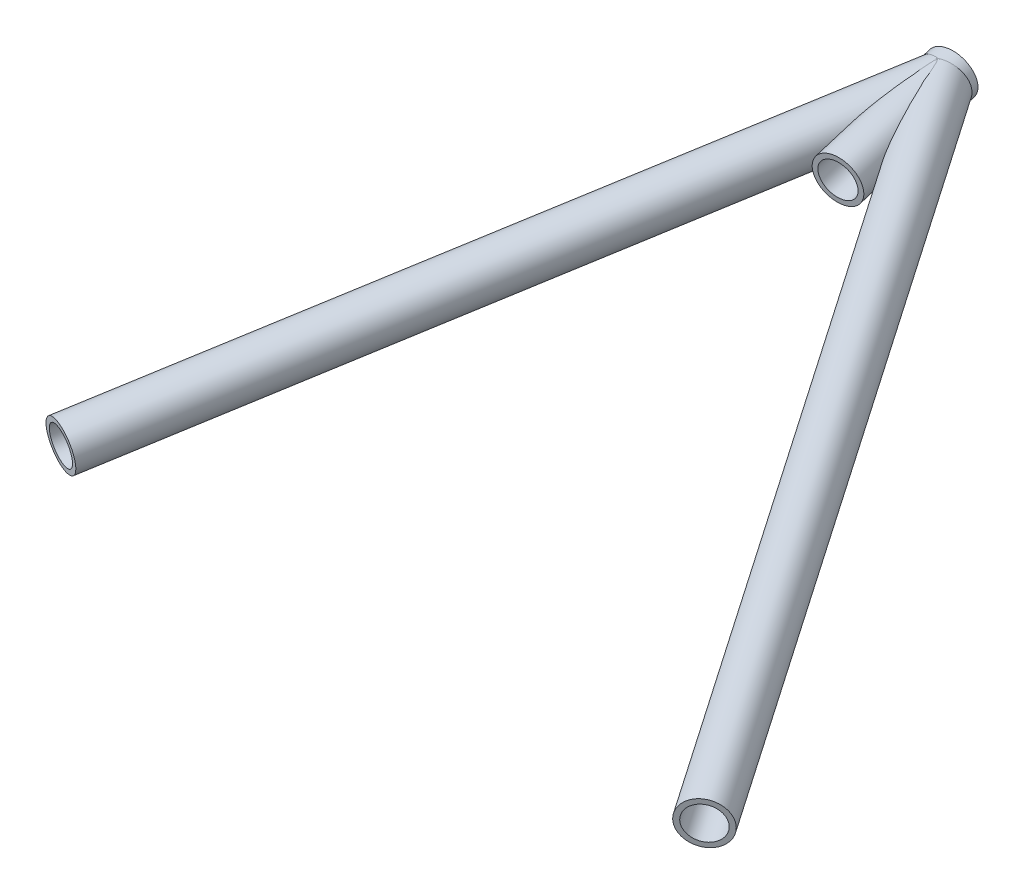
ISO-10303-21;
HEADER;
FILE_DESCRIPTION(('STEP AP214'),'2;1');
FILE_NAME('part.step','',(''),(''),'','','');
FILE_SCHEMA(('AUTOMOTIVE_DESIGN { 1 0 10303 214 1 1 1 1 }'));
ENDSEC;
DATA;
#1=APPLICATION_CONTEXT('core data for automotive mechanical design processes');
#2=APPLICATION_PROTOCOL_DEFINITION('international standard','automotive_design',2000,#1);
#3=PRODUCT_CONTEXT('',#1,'mechanical');
#4=PRODUCT('Part','Part','',(#3));
#5=PRODUCT_RELATED_PRODUCT_CATEGORY('part','',(#4));
#6=PRODUCT_DEFINITION_FORMATION('','',#4);
#7=PRODUCT_DEFINITION_CONTEXT('part definition',#1,'design');
#8=PRODUCT_DEFINITION('design','',#6,#7);
#9=PRODUCT_DEFINITION_SHAPE('','',#8);
#10=(LENGTH_UNIT() NAMED_UNIT(*) SI_UNIT(.MILLI.,.METRE.));
#11=(NAMED_UNIT(*) PLANE_ANGLE_UNIT() SI_UNIT($,.RADIAN.));
#12=(NAMED_UNIT(*) SI_UNIT($,.STERADIAN.) SOLID_ANGLE_UNIT());
#13=UNCERTAINTY_MEASURE_WITH_UNIT(LENGTH_MEASURE(1.E-05),#10,'distance_accuracy_value','');
#14=(GEOMETRIC_REPRESENTATION_CONTEXT(3) GLOBAL_UNCERTAINTY_ASSIGNED_CONTEXT((#13)) GLOBAL_UNIT_ASSIGNED_CONTEXT((#10,
#11,#12)) REPRESENTATION_CONTEXT('',''));
#15=CARTESIAN_POINT('',(0.,0.,0.));
#16=DIRECTION('',(0.,0.,1.));
#17=DIRECTION('',(1.,0.,0.));
#18=AXIS2_PLACEMENT_3D('',#15,#16,#17);
#19=CARTESIAN_POINT('',(4.04397858951078,301.981612494775,-650.872201759845));
#20=DIRECTION('',(0.537160814672258,-0.118768279923982,0.835076256915819));
#21=DIRECTION('',(0.841029061630512,0.,-0.540989942136544));
#22=AXIS2_PLACEMENT_3D('',#19,#20,#21);
#23=CYLINDRICAL_SURFACE('',#22,7.41679999999999);
#24=CARTESIAN_POINT('',(181.199371486471,262.811887676953,-375.464431215176));
#25=DIRECTION('',(-0.537160814672258,0.118768279923982,-0.835076256915819));
#26=DIRECTION('',(-0.841029061630512,0.,0.540989942136544));
#27=AXIS2_PLACEMENT_3D('',#24,#25,#26);
#28=CIRCLE('',#27,7.41679999999999);
#29=CARTESIAN_POINT('',(174.96162714217,262.811887676953,-371.452017012338));
#30=VERTEX_POINT('',#29);
#31=EDGE_CURVE('E109',#30,#30,#28,.T.);
#32=ORIENTED_EDGE('',*,*,#31,.F.);
#33=EDGE_LOOP('',(#32));
#34=FACE_BOUND('',#33,.T.);
#35=CARTESIAN_POINT('',(13.8206980198047,301.199131769866,-649.382885405639));
#36=CARTESIAN_POINT('',(13.8107554513525,301.004834071272,-649.398341630116));
#37=CARTESIAN_POINT('',(13.7955562754114,300.81031650493,-649.407729645231));
#38=CARTESIAN_POINT('',(13.7549430406658,300.42207729142,-649.414063919288));
#39=CARTESIAN_POINT('',(13.7295253039259,300.228355956228,-649.411005694874));
#40=CARTESIAN_POINT('',(13.668941958217,299.842741117412,-649.392047785591));
#41=CARTESIAN_POINT('',(13.6337601344558,299.650851208262,-649.376126655073));
#42=CARTESIAN_POINT('',(13.5544167889339,299.270537861153,-649.330981707171));
#43=CARTESIAN_POINT('',(13.5102560930672,299.082114106107,-649.301759112976));
#44=CARTESIAN_POINT('',(13.4138733302478,298.709728999547,-649.229479511083));
#45=CARTESIAN_POINT('',(13.3616395128709,298.525774612171,-649.18640223751));
#46=CARTESIAN_POINT('',(13.2504182639717,298.163900555168,-649.085932035394));
#47=CARTESIAN_POINT('',(13.1914306445094,297.985981053655,-649.028538708421));
#48=CARTESIAN_POINT('',(13.0683029136179,297.637614486215,-648.899045587752));
#49=CARTESIAN_POINT('',(13.0041674368784,297.467160907693,-648.826958934604));
#50=CARTESIAN_POINT('',(12.8725227679249,297.134801922059,-648.667725156594));
#51=CARTESIAN_POINT('',(12.8050137756413,296.97289600954,-648.580578923483));
#52=CARTESIAN_POINT('',(12.6712778858714,296.664743370898,-648.394730859944));
#53=CARTESIAN_POINT('',(12.6050995287082,296.518135582986,-648.296592926979));
#54=CARTESIAN_POINT('',(12.4735188770187,296.234788709822,-648.086519826771));
#55=CARTESIAN_POINT('',(12.4081165453744,296.09804915096,-647.974585322371));
#56=CARTESIAN_POINT('',(12.2801144376949,295.835180292405,-647.737583976231));
#57=CARTESIAN_POINT('',(12.2175132854605,295.709045755163,-647.612523686415));
#58=CARTESIAN_POINT('',(12.0969252721962,295.467697872211,-647.350245684631));
#59=CARTESIAN_POINT('',(12.0389382973799,295.352484257176,-647.213028272638));
#60=CARTESIAN_POINT('',(11.9324335470402,295.139664175803,-646.936470775977));
#61=CARTESIAN_POINT('',(11.8835549379273,295.041413898014,-646.797762846696));
#62=CARTESIAN_POINT('',(11.7921268498346,294.854321863066,-646.512189866713));
#63=CARTESIAN_POINT('',(11.749577031769,294.765479601915,-646.365325253612));
#64=CARTESIAN_POINT('',(11.6713411448821,294.596699505589,-646.064830133391));
#65=CARTESIAN_POINT('',(11.6356551461025,294.516761761284,-645.911199557248));
#66=CARTESIAN_POINT('',(11.5713225100739,294.365118415464,-645.598512850049));
#67=CARTESIAN_POINT('',(11.542676759512,294.293413851486,-645.439456038454));
#68=CARTESIAN_POINT('',(11.4745160510541,294.10931638736,-645.002956586368));
#69=CARTESIAN_POINT('',(11.4416681524004,294.004065976785,-644.721438375182));
#70=CARTESIAN_POINT('',(11.3945133199791,293.811412551757,-644.150839365053));
#71=CARTESIAN_POINT('',(11.3802205709604,293.724023234418,-643.861752952508));
#72=CARTESIAN_POINT('',(11.3676547219348,293.563276507303,-643.278011118803));
#73=CARTESIAN_POINT('',(11.3694552757307,293.489985182082,-642.98333625847));
#74=CARTESIAN_POINT('',(11.3823925957435,293.3888363993,-642.539762543802));
#75=CARTESIAN_POINT('',(11.3884098657996,293.356587970583,-642.391661137573));
#76=CARTESIAN_POINT('',(11.4035636408006,293.294724262012,-642.095064628122));
#77=CARTESIAN_POINT('',(11.4127001587891,293.265108993171,-641.946569523257));
#78=CARTESIAN_POINT('',(11.4403698044794,293.190601887475,-641.557073858043));
#79=CARTESIAN_POINT('',(11.4612153441587,293.147638280028,-641.315868062194));
#80=CARTESIAN_POINT('',(11.5093306970782,293.067025227133,-640.833194783426));
#81=CARTESIAN_POINT('',(11.5366014187548,293.029376534349,-640.591727268312));
#82=CARTESIAN_POINT('',(11.5966888754498,292.958666974247,-640.108693173126));
#83=CARTESIAN_POINT('',(11.6295083776565,292.925608411092,-639.867126603915));
#84=CARTESIAN_POINT('',(11.6999325025681,292.863542897817,-639.384164978302));
#85=CARTESIAN_POINT('',(11.7375374294296,292.834536205476,-639.142769933785));
#86=CARTESIAN_POINT('',(11.8567176155296,292.752789672647,-638.417935731447));
#87=CARTESIAN_POINT('',(11.9445212330136,292.705473529726,-637.934902731619));
#88=CARTESIAN_POINT('',(12.1326343148112,292.622827087972,-636.970447999279));
#89=CARTESIAN_POINT('',(12.2329406090138,292.587493759263,-636.489025889979));
#90=CARTESIAN_POINT('',(12.4434551203037,292.527294617559,-635.52655714508));
#91=CARTESIAN_POINT('',(12.5536853842878,292.502452845113,-635.045513865994));
#92=CARTESIAN_POINT('',(12.7817206302941,292.462547858227,-634.084805767346));
#93=CARTESIAN_POINT('',(12.8995260389886,292.44748519513,-633.605141027024));
#94=CARTESIAN_POINT('',(13.1409306332033,292.426816810737,-632.64779594404));
#95=CARTESIAN_POINT('',(13.2645213897946,292.421197745922,-632.170113754379));
#96=CARTESIAN_POINT('',(13.516411328825,292.419392275018,-631.215990617712));
#97=CARTESIAN_POINT('',(13.644710369853,292.423205585859,-630.739549633888));
#98=CARTESIAN_POINT('',(13.8799214879243,292.438921486653,-629.879689729575));
#99=CARTESIAN_POINT('',(13.9861833788896,292.449121191468,-629.496060816082));
#100=CARTESIAN_POINT('',(14.2007054888001,292.47620739905,-628.729598275498));
#101=CARTESIAN_POINT('',(14.3089656961835,292.493093863141,-628.34676464382));
#102=CARTESIAN_POINT('',(14.527181983303,292.534033654852,-627.581654372033));
#103=CARTESIAN_POINT('',(14.6371392612564,292.558092288589,-627.199378355607));
#104=CARTESIAN_POINT('',(14.8583183251295,292.614010550068,-626.435763523539));
#105=CARTESIAN_POINT('',(14.9695400977045,292.645870095556,-626.054424698058));
#106=CARTESIAN_POINT('',(15.1934681731951,292.718425677554,-625.290930753791));
#107=CARTESIAN_POINT('',(15.3061791171078,292.759165074646,-624.908781078082));
#108=CARTESIAN_POINT('',(15.5321785094427,292.850545730505,-624.14584243431));
#109=CARTESIAN_POINT('',(15.6454669377502,292.901186646651,-623.76505341963));
#110=CARTESIAN_POINT('',(15.8721007346009,293.013877097843,-623.005654652564));
#111=CARTESIAN_POINT('',(15.9854458833566,293.075913284109,-622.627042879387));
#112=CARTESIAN_POINT('',(16.2118236607391,293.213601848852,-621.872253458813));
#113=CARTESIAN_POINT('',(16.3248563347035,293.289252133989,-621.496075446392));
#114=CARTESIAN_POINT('',(16.5515921171423,293.458463104374,-620.741782734479));
#115=CARTESIAN_POINT('',(16.6652820235684,293.552262430083,-620.363716146541));
#116=CARTESIAN_POINT('',(16.8344160155779,293.70970872819,-619.800378882576));
#117=CARTESIAN_POINT('',(16.8906245544052,293.765055586023,-619.613012969272));
#118=CARTESIAN_POINT('',(17.0023269865388,293.882234253498,-619.240106821692));
#119=CARTESIAN_POINT('',(17.0578209422926,293.944065492091,-619.054566428223));
#120=CARTESIAN_POINT('',(17.1670852341023,294.074465041865,-618.68838232145));
#121=CARTESIAN_POINT('',(17.2208687294875,294.142930974963,-618.507706319901));
#122=CARTESIAN_POINT('',(17.3271367827908,294.28877169691,-618.149461260528));
#123=CARTESIAN_POINT('',(17.3796207886469,294.366150195782,-617.97189353227));
#124=CARTESIAN_POINT('',(17.482512372118,294.531428066245,-617.621954618945));
#125=CARTESIAN_POINT('',(17.5329271368028,294.619285979742,-617.449566126145));
#126=CARTESIAN_POINT('',(17.6310090110018,294.808334415285,-617.111519135431));
#127=CARTESIAN_POINT('',(17.6786791994058,294.909509561864,-616.945853160278));
#128=CARTESIAN_POINT('',(17.7419666422167,295.061738881909,-616.72310511854));
#129=CARTESIAN_POINT('',(17.759353466723,295.105594297412,-616.661591108606));
#130=CARTESIAN_POINT('',(17.7933756239575,295.196144273666,-616.540464547363));
#131=CARTESIAN_POINT('',(17.810010846675,295.242839247707,-616.480852274781));
#132=CARTESIAN_POINT('',(17.8586398969455,295.387790959813,-616.305218120446));
#133=CARTESIAN_POINT('',(17.889297291488,295.490774719078,-616.192608681576));
#134=CARTESIAN_POINT('',(17.9457559422173,295.713076172394,-615.979799913186));
#135=CARTESIAN_POINT('',(17.9714873156819,295.832592586709,-615.879785212915));
#136=CARTESIAN_POINT('',(18.0149324382546,296.08834761998,-615.701817230984));
#137=CARTESIAN_POINT('',(18.0326766769216,296.224520079901,-615.623780486867));
#138=CARTESIAN_POINT('',(18.0532713499871,296.465259679969,-615.519174428041));
#139=CARTESIAN_POINT('',(18.0590784815077,296.565873714768,-615.48412352593));
#140=CARTESIAN_POINT('',(18.0650145600515,296.771609509962,-615.430816702519));
#141=CARTESIAN_POINT('',(18.06514822251,296.876727454234,-615.412546846214));
#142=CARTESIAN_POINT('',(18.0596581510476,297.088297350189,-615.393583851262));
#143=CARTESIAN_POINT('',(18.0540375303252,297.194748549787,-615.392881213575));
#144=CARTESIAN_POINT('',(18.0376013191163,297.406092593281,-615.407816483679));
#145=CARTESIAN_POINT('',(18.0267800123076,297.510983591185,-615.423472394217));
#146=CARTESIAN_POINT('',(17.995293644553,297.761197018921,-615.478399434762));
#147=CARTESIAN_POINT('',(17.9723978823233,297.904621186416,-615.524907597489));
#148=CARTESIAN_POINT('',(17.9204844891648,298.181797380469,-615.638627340268));
#149=CARTESIAN_POINT('',(17.8914507338475,298.315522660461,-615.705893669902));
#150=CARTESIAN_POINT('',(17.831831899052,298.562661933225,-615.84883407259));
#151=CARTESIAN_POINT('',(17.8015741533158,298.676840949428,-615.923351329644));
#152=CARTESIAN_POINT('',(17.7385619814726,298.898031036011,-616.08151271483));
#153=CARTESIAN_POINT('',(17.705805281707,299.005035408218,-616.165165185166));
#154=CARTESIAN_POINT('',(17.6384255783912,299.212926212544,-616.339497651891));
#155=CARTESIAN_POINT('',(17.6037983621071,299.313797646337,-616.43019373129));
#156=CARTESIAN_POINT('',(17.5332295445294,299.509942979958,-616.616839926111));
#157=CARTESIAN_POINT('',(17.4972884793303,299.60521912239,-616.712787906355));
#158=CARTESIAN_POINT('',(17.402011844582,299.848032293815,-616.969097192271));
#159=CARTESIAN_POINT('',(17.3418714017792,299.991708464573,-617.132811258027));
#160=CARTESIAN_POINT('',(17.2198687826283,300.268950021873,-617.468030104825));
#161=CARTESIAN_POINT('',(17.1580056476228,300.402509618419,-617.639539258707));
#162=CARTESIAN_POINT('',(17.0330107940299,300.66144519822,-617.988692736611));
#163=CARTESIAN_POINT('',(16.9698769014913,300.786805259946,-618.16634802919));
#164=CARTESIAN_POINT('',(16.8428163464518,301.030404837181,-618.526205098945));
#165=CARTESIAN_POINT('',(16.7788895915806,301.148643513455,-618.708407408408));
#166=CARTESIAN_POINT('',(16.6501444507932,301.379647789057,-619.077479229946));
#167=CARTESIAN_POINT('',(16.5853230720726,301.492378858725,-619.264369230985));
#168=CARTESIAN_POINT('',(16.4553318142732,301.712457973887,-619.641173919875));
#169=CARTESIAN_POINT('',(16.3901619212934,301.819805802861,-619.831088728981));
#170=CARTESIAN_POINT('',(16.2597043589025,302.029616469677,-620.213209066749));
#171=CARTESIAN_POINT('',(16.1944169449979,302.132085351623,-620.405411371882));
#172=CARTESIAN_POINT('',(16.0637573976099,302.332791384079,-620.791977506002));
#173=CARTESIAN_POINT('',(15.998385264511,302.431028553731,-620.986341325207));
#174=CARTESIAN_POINT('',(15.8371384322317,302.668660633039,-621.468113843943));
#175=CARTESIAN_POINT('',(15.7412689629418,302.805863377599,-621.756606207294));
#176=CARTESIAN_POINT('',(15.5497985233848,303.0731252564,-622.336980071238));
#177=CARTESIAN_POINT('',(15.4541975712456,303.203183918835,-622.628861794131));
#178=CARTESIAN_POINT('',(15.2634601676564,303.456980081537,-623.215595364652));
#179=CARTESIAN_POINT('',(15.1683238305466,303.580716090362,-623.5104478936));
#180=CARTESIAN_POINT('',(14.9787344960356,303.82246003223,-624.102713588053));
#181=CARTESIAN_POINT('',(14.8842815198407,303.940467788154,-624.4001268324));
#182=CARTESIAN_POINT('',(14.601895243172,304.287085701375,-625.2968746333));
#183=CARTESIAN_POINT('',(14.4152754692229,304.507842587375,-625.899670861687));
#184=CARTESIAN_POINT('',(14.0471881546865,304.931246085693,-627.113001627444));
#185=CARTESIAN_POINT('',(13.8657198926076,305.133895242701,-627.723535063688));
#186=CARTESIAN_POINT('',(13.5104641592953,305.522084755134,-628.949633288493));
#187=CARTESIAN_POINT('',(13.3366514831961,305.707683844804,-629.565172190729));
#188=CARTESIAN_POINT('',(12.9984583368034,306.063361492773,-630.803410894434));
#189=CARTESIAN_POINT('',(12.834079141559,306.233437954825,-631.426111650323));
#190=CARTESIAN_POINT('',(12.5973519207687,306.476547585471,-632.365201393126));
#191=CARTESIAN_POINT('',(12.5201370642277,306.555528816983,-632.678835175192));
#192=CARTESIAN_POINT('',(12.3695231987774,306.709380683531,-633.30801811573));
#193=CARTESIAN_POINT('',(12.29612408388,306.784251432746,-633.623567220727));
#194=CARTESIAN_POINT('',(12.1538450344398,306.929621366978,-634.256611116682));
#195=CARTESIAN_POINT('',(12.0849641033075,307.000121515841,-634.574105461563));
#196=CARTESIAN_POINT('',(11.9525591569464,307.136383272681,-635.211211738377));
#197=CARTESIAN_POINT('',(11.8890348130101,307.202145171385,-635.530823539071));
#198=CARTESIAN_POINT('',(11.7936997071475,307.30189952318,-636.037793319201));
#199=CARTESIAN_POINT('',(11.7597609696554,307.337649887731,-636.224406297266));
#200=CARTESIAN_POINT('',(11.6943018581537,307.407209249287,-636.598413711423));
#201=CARTESIAN_POINT('',(11.6627814676325,307.441018259546,-636.785808142171));
#202=CARTESIAN_POINT('',(11.5722435545289,307.539291732322,-637.349284601614));
#203=CARTESIAN_POINT('',(11.5172619372174,307.600589485031,-637.72659357786));
#204=CARTESIAN_POINT('',(11.4208294893135,307.712744583423,-638.484400968268));
#205=CARTESIAN_POINT('',(11.3793746239635,307.763605040658,-638.864898396582));
#206=CARTESIAN_POINT('',(11.3135654477527,307.851909566596,-639.628930197575));
#207=CARTESIAN_POINT('',(11.2892054677399,307.889358081063,-640.012463520754));
#208=CARTESIAN_POINT('',(11.2664420771376,307.937188686062,-640.658936124305));
#209=CARTESIAN_POINT('',(11.2622365270215,307.952394438526,-640.921305562297));
#210=CARTESIAN_POINT('',(11.2655240690963,307.972445488695,-641.446453254083));
#211=CARTESIAN_POINT('',(11.2730181933755,307.977289872281,-641.709231541902));
#212=CARTESIAN_POINT('',(11.3013924323451,307.974082022274,-642.233529079733));
#213=CARTESIAN_POINT('',(11.3222460104897,307.966055307781,-642.49504979249));
#214=CARTESIAN_POINT('',(11.3788487055761,307.934064859867,-643.015509123865));
#215=CARTESIAN_POINT('',(11.4145913153083,307.910108085912,-643.274448819948));
#216=CARTESIAN_POINT('',(11.4897838349165,307.852103984059,-643.716302047748));
#217=CARTESIAN_POINT('',(11.5254834039723,307.82267095381,-643.900461252639));
#218=CARTESIAN_POINT('',(11.6050819454494,307.752332912932,-644.264755114554));
#219=CARTESIAN_POINT('',(11.6489783916898,307.711431434802,-644.444890992422));
#220=CARTESIAN_POINT('',(11.7444689809492,307.61700827392,-644.79960314473));
#221=CARTESIAN_POINT('',(11.7960572054311,307.563496276275,-644.974183569644));
#222=CARTESIAN_POINT('',(11.9059813439524,307.442933097652,-645.316430677527));
#223=CARTESIAN_POINT('',(11.9643172500652,307.37588193258,-645.484097368617));
#224=CARTESIAN_POINT('',(12.0866042238134,307.227342566793,-645.811968294007));
#225=CARTESIAN_POINT('',(12.1505832726029,307.145780119266,-645.972128527199));
#226=CARTESIAN_POINT('',(12.2820371901955,306.96839984021,-646.282840612164));
#227=CARTESIAN_POINT('',(12.3495121680977,306.872581563618,-646.433392163748));
#228=CARTESIAN_POINT('',(12.4859424828385,306.666997449703,-646.724103112909));
#229=CARTESIAN_POINT('',(12.5548988225317,306.557221899366,-646.864255164763));
#230=CARTESIAN_POINT('',(12.6921557089466,306.324505563358,-647.133499607498));
#231=CARTESIAN_POINT('',(12.7604562699759,306.20156506563,-647.262592240158));
#232=CARTESIAN_POINT('',(12.889747973434,305.952524131525,-647.500817212439));
#233=CARTESIAN_POINT('',(12.9509164180077,305.827244435488,-647.610713950574));
#234=CARTESIAN_POINT('',(13.0695572928337,305.567058551087,-647.820641144776));
#235=CARTESIAN_POINT('',(13.1270299287659,305.43215289931,-647.920672150058));
#236=CARTESIAN_POINT('',(13.2370612106326,305.153632416443,-648.110932552471));
#237=CARTESIAN_POINT('',(13.2896180912225,305.010014486893,-648.201158430258));
#238=CARTESIAN_POINT('',(13.3887472427961,304.71511339578,-648.371839176918));
#239=CARTESIAN_POINT('',(13.4353193034927,304.563829965136,-648.452293702452));
#240=CARTESIAN_POINT('',(13.524535097967,304.244139073096,-648.608626588527));
#241=CARTESIAN_POINT('',(13.5666995480357,304.075265652169,-648.683826573555));
#242=CARTESIAN_POINT('',(13.6423884635492,303.731151451199,-648.823247745801));
#243=CARTESIAN_POINT('',(13.675911845888,303.555909876085,-648.887467556381));
#244=CARTESIAN_POINT('',(13.7336536816471,303.20052872074,-649.004869438564));
#245=CARTESIAN_POINT('',(13.757883966705,303.020395683301,-649.058065505247));
#246=CARTESIAN_POINT('',(13.7966670940987,302.656288087719,-649.153477615197));
#247=CARTESIAN_POINT('',(13.8112231857635,302.472314840845,-649.195697342249));
#248=CARTESIAN_POINT('',(13.8301267934079,302.10749501039,-649.267936144824));
#249=CARTESIAN_POINT('',(13.8347806653411,301.926731783516,-649.298296856578));
#250=CARTESIAN_POINT('',(13.8347333734919,301.563754225291,-649.348516296471));
#251=CARTESIAN_POINT('',(13.8300321767305,301.381539888827,-649.368374987588));
#252=CARTESIAN_POINT('',(13.8206980198047,301.199131769866,-649.382885405639));
#253=B_SPLINE_CURVE_WITH_KNOTS('',3,(#35,#36,#37,#38,#39,#40,#41,#42,#43,#44,#45,#46,#47,#48,
#49,#50,#51,#52,#53,#54,#55,#56,#57,#58,#59,#60,#61,#62,#63,#64,#65,#66,#67,#68,#69,#70,#71,#72,
#73,#74,#75,#76,#77,#78,#79,#80,#81,#82,#83,#84,#85,#86,#87,#88,#89,#90,#91,#92,#93,#94,#95,#96,
#97,#98,#99,#100,#101,#102,#103,#104,#105,#106,#107,#108,#109,#110,#111,#112,#113,#114,#115,
#116,#117,#118,#119,#120,#121,#122,#123,#124,#125,#126,#127,#128,#129,#130,#131,#132,#133,#134,
#135,#136,#137,#138,#139,#140,#141,#142,#143,#144,#145,#146,#147,#148,#149,#150,#151,#152,#153,
#154,#155,#156,#157,#158,#159,#160,#161,#162,#163,#164,#165,#166,#167,#168,#169,#170,#171,#172,
#173,#174,#175,#176,#177,#178,#179,#180,#181,#182,#183,#184,#185,#186,#187,#188,#189,#190,#191,
#192,#193,#194,#195,#196,#197,#198,#199,#200,#201,#202,#203,#204,#205,#206,#207,#208,#209,#210,
#211,#212,#213,#214,#215,#216,#217,#218,#219,#220,#221,#222,#223,#224,#225,#226,#227,#228,#229,
#230,#231,#232,#233,#234,#235,#236,#237,#238,#239,#240,#241,#242,#243,#244,#245,#246,#247,#248,
#249,#250,#251,#252),.UNSPECIFIED.,.T.,.F.,(4,2,2,2,2,2,2,2,2,2,2,2,2,2,2,2,2,2,2,2,2,2,2,2,2,2,
2,2,2,2,2,2,2,2,2,2,2,2,2,2,2,2,2,2,2,2,2,2,2,2,2,2,2,2,2,2,2,2,2,2,2,2,2,2,2,2,2,2,2,2,2,2,2,2,
2,2,2,2,2,2,2,2,2,2,2,2,2,2,2,2,2,2,2,2,2,2,2,2,2,2,2,2,2,2,2,2,2,2,4),(0.,0.585339332463419,
1.17088953320785,1.75741801079551,2.34389256274812,2.93122890956883,3.51858160434436,
4.10541130411829,4.69220626678487,5.25673706545461,5.82124075232614,6.38546398728098,
6.94967330407462,7.47970328088201,8.00970484936606,8.53971182594662,9.06978552031288,
9.97521162470265,10.8813294882015,11.7915964738424,12.246627676682,12.7016607823286,
13.4391449064683,14.176733363816,14.9146907489488,15.6526950613327,17.1319243797473,
18.6107793928655,20.0930049341612,21.575314035544,23.0555269126565,24.5356953685884,
25.7302513401707,26.9248004024914,28.1202354188921,29.3156578309477,30.5170537927015,
31.7184081901135,32.9183641552208,34.1181357692345,35.3349111777392,35.9447071941789,
36.5544495537494,37.1559488705621,37.757699483775,38.3571438710064,38.9559021404522,
39.1883970864298,39.4209259527903,39.8867578032123,40.3587747928442,40.8289743294252,
41.1476765000444,41.4661137800099,41.7843788691335,42.1029945814495,42.5579039477143,
43.0140235411354,43.4323883886933,43.8511385300295,44.2708746464214,44.6904413672434,
45.3678184095239,46.0455802492697,46.724621296827,47.4037422114612,48.0866834263252,
48.7696520876321,49.4517514083579,50.1338476432255,51.1343261456485,52.1348706419628,
53.1356500758229,54.1364604340277,56.1416436428268,58.1465446174266,60.1442575501291,
62.1422398650409,63.1397435019326,64.1372194167854,65.1344745703234,66.1316684826034,
66.7106855101157,67.2896985839679,68.4479306857602,69.60581699377,70.7633191319334,
71.5514791759963,72.3397087516265,73.126377462019,73.912702721165,74.4818547323608,
75.0508316262585,75.6193729516979,76.1879136092755,76.7594515460929,77.3310073299173,
77.9029630650519,78.4749062929343,79.006893965938,79.5388520069978,80.0710003570111,
80.6031673998752,81.1713560526085,81.7396158897945,82.3071498181145,82.8744930289703,
83.4240119937709,83.9735328957724),.UNSPECIFIED.);
#254=CARTESIAN_POINT('',(13.8206980198047,301.199131769866,-649.382885405639));
#255=VERTEX_POINT('',#254);
#256=EDGE_CURVE('E83',#255,#255,#253,.T.);
#257=ORIENTED_EDGE('',*,*,#256,.T.);
#258=EDGE_LOOP('',(#257));
#259=FACE_BOUND('',#258,.T.);
#260=ADVANCED_FACE('F65',(#34,#259),#23,.F.);
#261=CARTESIAN_POINT('',(10.1712188766484,294.809656352147,-601.770063603224));
#262=DIRECTION('',(-0.122544805742753,0.143439122852553,-0.982042763132422));
#263=DIRECTION('',(0.,0.989500647349858,0.144528436282319));
#264=AXIS2_PLACEMENT_3D('',#261,#262,#263);
#265=CYLINDRICAL_SURFACE('',#264,9.52500000000001);
#266=ORIENTED_EDGE('',*,*,#256,.F.);
#267=EDGE_LOOP('',(#266));
#268=FACE_BOUND('',#267,.T.);
#269=CARTESIAN_POINT('',(4.0439785895108,301.981612494775,-650.872201759845));
#270=DIRECTION('',(0.941060120574561,0.0559957790365611,-0.333572064469255));
#271=DIRECTION('',(0.338160058557685,-0.134405510478131,0.931441320507833));
#272=AXIS2_PLACEMENT_3D('',#269,#270,#271);
#273=ELLIPSE('',#272,43.2380682628042,9.525);
#274=CARTESIAN_POINT('',(4.11372881922309,292.558120131745,-652.257319657128));
#275=VERTEX_POINT('',#274);
#276=CARTESIAN_POINT('',(3.97422835979851,311.405104857805,-649.487083862563));
#277=VERTEX_POINT('',#276);
#278=EDGE_CURVE('E74',#275,#277,#273,.F.);
#279=ORIENTED_EDGE('',*,*,#278,.T.);
#280=CARTESIAN_POINT('',(4.0439785895108,301.981612494775,-650.872201759845));
#281=DIRECTION('',(0.338160058557685,-0.134405510478131,0.931441320507833));
#282=DIRECTION('',(0.941060120574561,0.0559957790365611,-0.333572064469255));
#283=AXIS2_PLACEMENT_3D('',#280,#281,#282);
#284=ELLIPSE('',#283,9.76488439111884,9.525);
#285=EDGE_CURVE('E13',#277,#275,#284,.F.);
#286=ORIENTED_EDGE('',*,*,#285,.T.);
#287=EDGE_LOOP('',(#279,#286));
#288=FACE_BOUND('',#287,.T.);
#289=ADVANCED_FACE('F81',(#268,#288),#265,.F.);
#290=CARTESIAN_POINT('',(4.04397858951078,301.981612494775,-650.872201759845));
#291=DIRECTION('',(0.537160814672258,-0.118768279923982,0.835076256915819));
#292=DIRECTION('',(0.841029061630512,0.,-0.540989942136544));
#293=AXIS2_PLACEMENT_3D('',#290,#291,#292);
#294=CYLINDRICAL_SURFACE('',#293,9.525);
#295=CARTESIAN_POINT('',(181.199371486471,262.811887676953,-375.464431215176));
#296=DIRECTION('',(-0.537160814672258,0.118768279923982,-0.835076256915819));
#297=DIRECTION('',(-0.841029061630512,0.,0.540989942136544));
#298=AXIS2_PLACEMENT_3D('',#295,#296,#297);
#299=CIRCLE('',#298,9.525);
#300=CARTESIAN_POINT('',(173.18856967444,262.811887676953,-370.311502016325));
#301=VERTEX_POINT('',#300);
#302=EDGE_CURVE('E69',#301,#301,#299,.T.);
#303=ORIENTED_EDGE('',*,*,#302,.T.);
#304=EDGE_LOOP('',(#303));
#305=FACE_BOUND('',#304,.T.);
#306=ORIENTED_EDGE('',*,*,#278,.F.);
#307=ORIENTED_EDGE('',*,*,#285,.F.);
#308=EDGE_LOOP('',(#306,#307));
#309=FACE_BOUND('',#308,.T.);
#310=ADVANCED_FACE('F67',(#305,#309),#294,.T.);
#311=CARTESIAN_POINT('',(181.199371486471,262.811887676954,-375.464431215176));
#312=DIRECTION('',(-0.537160814672258,0.118768279923982,-0.835076256915819));
#313=DIRECTION('',(-0.841029061630512,0.,0.540989942136544));
#314=AXIS2_PLACEMENT_3D('',#311,#312,#313);
#315=PLANE('',#314);
#316=ORIENTED_EDGE('',*,*,#31,.T.);
#317=EDGE_LOOP('',(#316));
#318=FACE_BOUND('',#317,.T.);
#319=ORIENTED_EDGE('',*,*,#302,.F.);
#320=EDGE_LOOP('',(#319));
#321=FACE_BOUND('',#320,.T.);
#322=ADVANCED_FACE('F86',(#318,#321),#315,.F.);
#323=CLOSED_SHELL('',(#260,#289,#310,#322));
#324=MANIFOLD_SOLID_BREP('B2',#323);
#325=CARTESIAN_POINT('',(-99.9999999999998,256.434476218686,-346.236762223122));
#326=DIRECTION('',(0.320018024842971,0.140093687168908,-0.936996383446075));
#327=DIRECTION('',(-0.946328839633178,0.,-0.323205394878431));
#328=AXIS2_PLACEMENT_3D('',#325,#326,#327);
#329=CYLINDRICAL_SURFACE('',#328,7.41679999999999);
#330=CARTESIAN_POINT('',(-88.7993691304958,261.337755269598,-379.031635643735));
#331=DIRECTION('',(0.320018024842971,0.140093687168908,-0.936996383446075));
#332=DIRECTION('',(-0.946328839633178,0.,-0.323205394878431));
#333=AXIS2_PLACEMENT_3D('',#330,#331,#332);
#334=CIRCLE('',#333,7.41679999999999);
#335=CARTESIAN_POINT('',(-95.8181008682872,261.337755269598,-381.428785416469));
#336=VERTEX_POINT('',#335);
#337=EDGE_CURVE('E184',#336,#336,#334,.T.);
#338=ORIENTED_EDGE('',*,*,#337,.F.);
#339=EDGE_LOOP('',(#338));
#340=FACE_BOUND('',#339,.T.);
#341=CARTESIAN_POINT('',(-5.07233249655578,301.063359139598,-647.127746651762));
#342=CARTESIAN_POINT('',(-5.08057709325055,301.259684415892,-647.103603558293));
#343=CARTESIAN_POINT('',(-5.08203640500365,301.455785733625,-647.074784010796));
#344=CARTESIAN_POINT('',(-5.07135862024191,301.846136891764,-647.007992991406));
#345=CARTESIAN_POINT('',(-5.05921329627936,302.040385540083,-646.97001599242));
#346=CARTESIAN_POINT('',(-5.02144713438112,302.426026247894,-646.884889557591));
#347=CARTESIAN_POINT('',(-4.99579487567958,302.617410572089,-646.837718896648));
#348=CARTESIAN_POINT('',(-4.93136465241606,302.995432593523,-646.734215605233));
#349=CARTESIAN_POINT('',(-4.89258674934015,303.182070312993,-646.677883017681));
#350=CARTESIAN_POINT('',(-4.8024740737869,303.549198873559,-646.555875128191));
#351=CARTESIAN_POINT('',(-4.75113726125613,303.729688710569,-646.490198309114));
#352=CARTESIAN_POINT('',(-4.63671057913948,304.083039328403,-646.349221201359));
#353=CARTESIAN_POINT('',(-4.57362019373789,304.255899773993,-646.273920490374));
#354=CARTESIAN_POINT('',(-4.43679396856856,304.592390178724,-646.113373524931));
#355=CARTESIAN_POINT('',(-4.36306567613499,304.756026568594,-646.028134329744));
#356=CARTESIAN_POINT('',(-4.20627168779448,305.072724431992,-645.847227188151));
#357=CARTESIAN_POINT('',(-4.12320636907637,305.225786332294,-645.751559663024));
#358=CARTESIAN_POINT('',(-3.95149295267558,305.516342995383,-645.55179636062));
#359=CARTESIAN_POINT('',(-3.86302853578585,305.654124785235,-645.447960480173));
#360=CARTESIAN_POINT('',(-3.68060925343506,305.917008445376,-645.229595139121));
#361=CARTESIAN_POINT('',(-3.58665453171492,306.042110647393,-645.115065958428));
#362=CARTESIAN_POINT('',(-3.39542338505047,306.27846673069,-644.875253095189));
#363=CARTESIAN_POINT('',(-3.29814977672976,306.389731999828,-644.749978401679));
#364=CARTESIAN_POINT('',(-3.10247561975599,306.59774594542,-644.488722268227));
#365=CARTESIAN_POINT('',(-3.00407515667007,306.694495716337,-644.352741636689));
#366=CARTESIAN_POINT('',(-2.81570561627911,306.866473026161,-644.081052702542));
#367=CARTESIAN_POINT('',(-2.72565308991791,306.942765311368,-643.946074150318));
#368=CARTESIAN_POINT('',(-2.54822274468801,307.08268046345,-643.668033331305));
#369=CARTESIAN_POINT('',(-2.46084504760579,307.146302754177,-643.524970697284));
#370=CARTESIAN_POINT('',(-2.29021761642912,307.261302631084,-643.231707806066));
#371=CARTESIAN_POINT('',(-2.20696701518271,307.312682798188,-643.081509061351));
#372=CARTESIAN_POINT('',(-2.04563305894732,307.403986405838,-642.77498828784));
#373=CARTESIAN_POINT('',(-1.96755044348384,307.443908209436,-642.618665387767));
#374=CARTESIAN_POINT('',(-1.78654907875723,307.527447898765,-642.236078101194));
#375=CARTESIAN_POINT('',(-1.6865086420538,307.565918209161,-642.007319750769));
#376=CARTESIAN_POINT('',(-1.49876999601676,307.625202139719,-641.542576372038));
#377=CARTESIAN_POINT('',(-1.41107773593778,307.646007273053,-641.306587926543));
#378=CARTESIAN_POINT('',(-1.24744027952672,307.673064758457,-640.828964741442));
#379=CARTESIAN_POINT('',(-1.17153429595453,307.679269464792,-640.587314107786));
#380=CARTESIAN_POINT('',(-1.03088207392797,307.679703494234,-640.100889694105));
#381=CARTESIAN_POINT('',(-0.96613407938328,307.673934703647,-639.85611641206));
#382=CARTESIAN_POINT('',(-0.825512318801068,307.648940879439,-639.278006492234));
#383=CARTESIAN_POINT('',(-0.753756240883387,307.625690912149,-638.943851721239));
#384=CARTESIAN_POINT('',(-0.625399792754563,307.565642626508,-638.273786388398));
#385=CARTESIAN_POINT('',(-0.568807624831217,307.52883700124,-637.937874976112));
#386=CARTESIAN_POINT('',(-0.468045634688803,307.444546447313,-637.264886915072));
#387=CARTESIAN_POINT('',(-0.423900640837123,307.39704050938,-636.92780927619));
#388=CARTESIAN_POINT('',(-0.345954491284497,307.293478096382,-636.253872695781));
#389=CARTESIAN_POINT('',(-0.312151445574622,307.237423186465,-635.917013725534));
#390=CARTESIAN_POINT('',(-0.252898224421249,307.11785586592,-635.241898967132));
#391=CARTESIAN_POINT('',(-0.227497057313588,307.054302535771,-634.903646245573));
#392=CARTESIAN_POINT('',(-0.183839039798984,306.921014872539,-634.227901001792));
#393=CARTESIAN_POINT('',(-0.165582432592793,306.851280329147,-633.890408505838));
#394=CARTESIAN_POINT('',(-0.135050640687783,306.706417550935,-633.216723443075));
#395=CARTESIAN_POINT('',(-0.122768667616517,306.631295549267,-632.880529833553));
#396=CARTESIAN_POINT('',(-0.103210044484637,306.476060473594,-632.209147988915));
#397=CARTESIAN_POINT('',(-0.095933537177399,306.395947257314,-631.873959782742));
#398=CARTESIAN_POINT('',(-0.0838812674295373,306.203353913493,-631.092273780297));
#399=CARTESIAN_POINT('',(-0.080766244426857,306.089040063292,-630.646201966159));
#400=CARTESIAN_POINT('',(-0.0806417462217565,305.852476248173,-629.756164046485));
#401=CARTESIAN_POINT('',(-0.0836324419168874,305.730226061213,-629.312198000237));
#402=CARTESIAN_POINT('',(-0.0946105028134257,305.477826146868,-628.426340776179));
#403=CARTESIAN_POINT('',(-0.102600371379306,305.347672491279,-627.984450749708));
#404=CARTESIAN_POINT('',(-0.122699666729587,305.079380266455,-627.103203486392));
#405=CARTESIAN_POINT('',(-0.134809031650453,304.941241817156,-626.663846211611));
#406=CARTESIAN_POINT('',(-0.162384546233164,304.657222018021,-625.78983872471));
#407=CARTESIAN_POINT('',(-0.177836015468198,304.511376574517,-625.355176389959));
#408=CARTESIAN_POINT('',(-0.211558723837332,304.210803163783,-624.489026811751));
#409=CARTESIAN_POINT('',(-0.229830033028942,304.056074975925,-624.057539647459));
#410=CARTESIAN_POINT('',(-0.268707470233989,303.736952752085,-623.19848591057));
#411=CARTESIAN_POINT('',(-0.289312486723988,303.572563335457,-622.77091757549));
#412=CARTESIAN_POINT('',(-0.332452573681699,303.232863164096,-621.920257502998));
#413=CARTESIAN_POINT('',(-0.354987511611362,303.057553159564,-621.497165460413));
#414=CARTESIAN_POINT('',(-0.401640732662212,302.6941444763,-620.656059322027));
#415=CARTESIAN_POINT('',(-0.425760632780465,302.506032729885,-620.23805094433));
#416=CARTESIAN_POINT('',(-0.475212888592688,302.11475569336,-619.40895533652));
#417=CARTESIAN_POINT('',(-0.500545676540207,301.91158502214,-618.99787064552));
#418=CARTESIAN_POINT('',(-0.539183096088928,301.592708674569,-618.388007268301));
#419=CARTESIAN_POINT('',(-0.552185836513586,301.48391331704,-618.185589416771));
#420=CARTESIAN_POINT('',(-0.578335765859221,301.261064919514,-617.783684723243));
#421=CARTESIAN_POINT('',(-0.591482945022743,301.147012233029,-617.584197685357));
#422=CARTESIAN_POINT('',(-0.617846293532403,300.912977265552,-617.188906853005));
#423=CARTESIAN_POINT('',(-0.631062410604791,300.792999019019,-616.993100674457));
#424=CARTESIAN_POINT('',(-0.657487226214965,300.546099148357,-616.605934315117));
#425=CARTESIAN_POINT('',(-0.670695925554169,300.419178540573,-616.41457348935));
#426=CARTESIAN_POINT('',(-0.697102040669243,300.15610067695,-616.036030459765));
#427=CARTESIAN_POINT('',(-0.710298551258397,300.019878646626,-615.848892937532));
#428=CARTESIAN_POINT('',(-0.736429027852739,299.737286086606,-615.482120378254));
#429=CARTESIAN_POINT('',(-0.749362786625791,299.590907920059,-615.302491153282));
#430=CARTESIAN_POINT('',(-0.774662756569135,299.286492960399,-614.954679300562));
#431=CARTESIAN_POINT('',(-0.787031266306935,299.128511782671,-614.786448658708));
#432=CARTESIAN_POINT('',(-0.810869264449682,298.797468795983,-614.465672983777));
#433=CARTESIAN_POINT('',(-0.822340360794878,298.624435189805,-614.313099736131));
#434=CARTESIAN_POINT('',(-0.841681497680955,298.294366406668,-614.059120735717));
#435=CARTESIAN_POINT('',(-0.849820207480909,298.140629626021,-613.953514020421));
#436=CARTESIAN_POINT('',(-0.864462134290238,297.819038554653,-613.766351424907));
#437=CARTESIAN_POINT('',(-0.870970626176602,297.651232204399,-613.68471782334));
#438=CARTESIAN_POINT('',(-0.879476761068998,297.366989173721,-613.58132162412));
#439=CARTESIAN_POINT('',(-0.882251929914337,297.254628649392,-613.548583392556));
#440=CARTESIAN_POINT('',(-0.886496270940558,297.026084366279,-613.501196909597));
#441=CARTESIAN_POINT('',(-0.887966944270156,296.909905161991,-613.486527857507));
#442=CARTESIAN_POINT('',(-0.889366213265536,296.675674492161,-613.478295622157));
#443=CARTESIAN_POINT('',(-0.889281542735407,296.557615509904,-613.484913611051));
#444=CARTESIAN_POINT('',(-0.887456264493678,296.32493347832,-613.520516487409));
#445=CARTESIAN_POINT('',(-0.885715725336811,296.210310286949,-613.549500448889));
#446=CARTESIAN_POINT('',(-0.880992119530646,295.999762177466,-613.623550895921));
#447=CARTESIAN_POINT('',(-0.878155256589638,295.903126634375,-613.666656723881));
#448=CARTESIAN_POINT('',(-0.871485767549604,295.717083648511,-613.766196603967));
#449=CARTESIAN_POINT('',(-0.867652592308501,295.627680227645,-613.822638004758));
#450=CARTESIAN_POINT('',(-0.856265018596798,295.396613217452,-613.988956532116));
#451=CARTESIAN_POINT('',(-0.847981708606486,295.262072613784,-614.108618323289));
#452=CARTESIAN_POINT('',(-0.830053978715324,295.01233016625,-614.366583666374));
#453=CARTESIAN_POINT('',(-0.820404933194729,294.897197083746,-614.504950495879));
#454=CARTESIAN_POINT('',(-0.800225549555821,294.682071858599,-614.794327028293));
#455=CARTESIAN_POINT('',(-0.789689234319899,294.582197697294,-614.945422481));
#456=CARTESIAN_POINT('',(-0.768116619668257,294.395319572888,-615.255423671112));
#457=CARTESIAN_POINT('',(-0.757079788049734,294.308329749782,-615.414337738105));
#458=CARTESIAN_POINT('',(-0.734691590113129,294.144645977472,-615.737782811623));
#459=CARTESIAN_POINT('',(-0.723339529395906,294.067977365988,-615.902326440774));
#460=CARTESIAN_POINT('',(-0.700483971211482,293.923345861569,-616.235048623102));
#461=CARTESIAN_POINT('',(-0.6889805542241,293.855378533081,-616.403225272802));
#462=CARTESIAN_POINT('',(-0.667104015186873,293.733372995263,-616.724695989112));
#463=CARTESIAN_POINT('',(-0.656737559901673,293.678621260343,-616.877722086228));
#464=CARTESIAN_POINT('',(-0.635995622382079,293.574153005478,-617.185488231589));
#465=CARTESIAN_POINT('',(-0.625620139411771,293.524436944408,-617.340228434607));
#466=CARTESIAN_POINT('',(-0.594526788032695,293.38182362548,-617.806604015103));
#467=CARTESIAN_POINT('',(-0.573851163719084,293.295510657627,-618.120260277375));
#468=CARTESIAN_POINT('',(-0.532790575159813,293.136577980052,-618.751633002405));
#469=CARTESIAN_POINT('',(-0.512406273540107,293.063985949573,-619.069356320437));
#470=CARTESIAN_POINT('',(-0.47212077952181,292.930175678286,-619.707238565805));
#471=CARTESIAN_POINT('',(-0.452219642882903,292.868958744849,-620.027397768707));
#472=CARTESIAN_POINT('',(-0.412947862475075,292.755846620098,-620.670813633492));
#473=CARTESIAN_POINT('',(-0.393579902376919,292.703993129003,-620.994077710864));
#474=CARTESIAN_POINT('',(-0.355584046295141,292.608577102898,-621.641877183259));
#475=CARTESIAN_POINT('',(-0.336956187578397,292.565014984972,-621.9664126414));
#476=CARTESIAN_POINT('',(-0.300582647433496,292.485205688381,-622.616006755206));
#477=CARTESIAN_POINT('',(-0.282835880505192,292.448949331595,-622.941064230737));
#478=CARTESIAN_POINT('',(-0.248321317533621,292.382892527736,-623.591886536411));
#479=CARTESIAN_POINT('',(-0.231553540421746,292.353092205478,-623.917651380107));
#480=CARTESIAN_POINT('',(-0.190925394152259,292.285717555019,-624.734633848367));
#481=CARTESIAN_POINT('',(-0.167767550255649,292.251835505767,-625.226192610708));
#482=CARTESIAN_POINT('',(-0.124469385265978,292.195689999955,-626.210112865871));
#483=CARTESIAN_POINT('',(-0.104329200882271,292.173427069663,-626.702474394039));
#484=CARTESIAN_POINT('',(-0.0676622118545903,292.139414646949,-627.688036030488));
#485=CARTESIAN_POINT('',(-0.0511379376948768,292.127672499505,-628.181236484155));
#486=CARTESIAN_POINT('',(-0.0224732399931386,292.11399240435,-629.16788754969));
#487=CARTESIAN_POINT('',(-0.0103327150481694,292.112054229844,-629.661338155507));
#488=CARTESIAN_POINT('',(0.00858025502221795,292.117553391305,-630.646500967238));
#489=CARTESIAN_POINT('',(0.0153720164887033,292.124956737109,-631.138212984821));
#490=CARTESIAN_POINT('',(0.0224517292745807,292.148971783607,-632.121486765106));
#491=CARTESIAN_POINT('',(0.0227394039515545,292.165583875952,-632.613048520528));
#492=CARTESIAN_POINT('',(0.0152282672270341,292.208236066461,-633.595421161707));
#493=CARTESIAN_POINT('',(0.00743422806372425,292.234270594786,-634.086232319393));
#494=CARTESIAN_POINT('',(-0.0183309446386126,292.296423122996,-635.066923183498));
#495=CARTESIAN_POINT('',(-0.0363009387044925,292.332539993659,-635.556802988046));
#496=CARTESIAN_POINT('',(-0.0808648149254558,292.408602697456,-636.446765164883));
#497=CARTESIAN_POINT('',(-0.105319310925539,292.446683711131,-636.847111065668));
#498=CARTESIAN_POINT('',(-0.165096239741603,292.531649358345,-637.646148906052));
#499=CARTESIAN_POINT('',(-0.200420213812021,292.578535240016,-638.044840602961));
#500=CARTESIAN_POINT('',(-0.28467432901911,292.682893475365,-638.839691767374));
#501=CARTESIAN_POINT('',(-0.33361292014118,292.740372396166,-639.235849505446));
#502=CARTESIAN_POINT('',(-0.448589471378676,292.868529722619,-640.023533337893));
#503=CARTESIAN_POINT('',(-0.514622050279581,292.939203972413,-640.415060849383));
#504=CARTESIAN_POINT('',(-0.643401834937058,293.072179702705,-641.065271937604));
#505=CARTESIAN_POINT('',(-0.700332295734868,293.129822811842,-641.32605055286));
#506=CARTESIAN_POINT('',(-0.825628727206515,293.254755330468,-641.842600849587));
#507=CARTESIAN_POINT('',(-0.893995964358575,293.322045808164,-642.098371973032));
#508=CARTESIAN_POINT('',(-1.04354068501107,293.468250582014,-642.602155985192));
#509=CARTESIAN_POINT('',(-1.12468941419561,293.547138761088,-642.850184825849));
#510=CARTESIAN_POINT('',(-1.30116946712678,293.71921457084,-643.336044399716));
#511=CARTESIAN_POINT('',(-1.39649405499098,293.812395410794,-643.573879907679));
#512=CARTESIAN_POINT('',(-1.57149444642855,293.985870395634,-643.967399963489));
#513=CARTESIAN_POINT('',(-1.64749112294847,294.061857160639,-644.126621558298));
#514=CARTESIAN_POINT('',(-1.80649908845312,294.223318945571,-644.43649837912));
#515=CARTESIAN_POINT('',(-1.88950810173205,294.308790890086,-644.587156357924));
#516=CARTESIAN_POINT('',(-2.06179574094116,294.490009964711,-644.878193293721));
#517=CARTESIAN_POINT('',(-2.15106916603555,294.585748605294,-645.018580584378));
#518=CARTESIAN_POINT('',(-2.33473463193646,294.788160669434,-645.287669231517));
#519=CARTESIAN_POINT('',(-2.42912662680514,294.894833994863,-645.416370692849));
#520=CARTESIAN_POINT('',(-2.62194596311162,295.1201015277,-645.661597072777));
#521=CARTESIAN_POINT('',(-2.72039522959767,295.238767529244,-645.778038960321));
#522=CARTESIAN_POINT('',(-2.91865956577546,295.48734256238,-645.996935853468));
#523=CARTESIAN_POINT('',(-3.01847467783052,295.617251943366,-646.099390424151));
#524=CARTESIAN_POINT('',(-3.21724816357235,295.887928503844,-646.289999018838));
#525=CARTESIAN_POINT('',(-3.31620598221384,296.028702206766,-646.378144350798));
#526=CARTESIAN_POINT('',(-3.51094075665522,296.320293586956,-646.540153998548));
#527=CARTESIAN_POINT('',(-3.60671780882459,296.471110959508,-646.614018747332));
#528=CARTESIAN_POINT('',(-3.78520305433481,296.768834474303,-646.742313132365));
#529=CARTESIAN_POINT('',(-3.86833422311191,296.915012100392,-646.797851784016));
#530=CARTESIAN_POINT('',(-4.02875431383894,297.214191298867,-646.897829922452));
#531=CARTESIAN_POINT('',(-4.10604360493425,297.367192439105,-646.942270110952));
#532=CARTESIAN_POINT('',(-4.25360840558752,297.679255528187,-647.020662794176));
#533=CARTESIAN_POINT('',(-4.32387976708363,297.8383209856,-647.054609110871));
#534=CARTESIAN_POINT('',(-4.45633788417697,298.16154024383,-647.112582705735));
#535=CARTESIAN_POINT('',(-4.51852444790371,298.325694165295,-647.136609748526));
#536=CARTESIAN_POINT('',(-4.63778710620096,298.66916228063,-647.176598689868));
#537=CARTESIAN_POINT('',(-4.69425519355708,298.848762080271,-647.191923769195));
#538=CARTESIAN_POINT('',(-4.79624988840716,299.211608435529,-647.212588456608));
#539=CARTESIAN_POINT('',(-4.84177607228562,299.394855132039,-647.217927678145));
#540=CARTESIAN_POINT('',(-4.92120206883008,299.76350257103,-647.219163272546));
#541=CARTESIAN_POINT('',(-4.95512412793555,299.948898479344,-647.215077831395));
#542=CARTESIAN_POINT('',(-5.01102160681016,300.320995658643,-647.197946573917));
#543=CARTESIAN_POINT('',(-5.03300356416591,300.507696158486,-647.184905669865));
#544=CARTESIAN_POINT('',(-5.05412055970091,300.755949358767,-647.161854690323));
#545=CARTESIAN_POINT('',(-5.05869026587446,300.817445500446,-647.155679075584));
#546=CARTESIAN_POINT('',(-5.06650578046274,300.940421456782,-647.142403942116));
#547=CARTESIAN_POINT('',(-5.06975159945882,301.001901271565,-647.135304430772));
#548=CARTESIAN_POINT('',(-5.07233249655578,301.063359139598,-647.127746651762));
#549=B_SPLINE_CURVE_WITH_KNOTS('',3,(#341,#342,#343,#344,#345,#346,#347,#348,#349,#350,#351,
#352,#353,#354,#355,#356,#357,#358,#359,#360,#361,#362,#363,#364,#365,#366,#367,#368,#369,#370,
#371,#372,#373,#374,#375,#376,#377,#378,#379,#380,#381,#382,#383,#384,#385,#386,#387,#388,#389,
#390,#391,#392,#393,#394,#395,#396,#397,#398,#399,#400,#401,#402,#403,#404,#405,#406,#407,#408,
#409,#410,#411,#412,#413,#414,#415,#416,#417,#418,#419,#420,#421,#422,#423,#424,#425,#426,#427,
#428,#429,#430,#431,#432,#433,#434,#435,#436,#437,#438,#439,#440,#441,#442,#443,#444,#445,#446,
#447,#448,#449,#450,#451,#452,#453,#454,#455,#456,#457,#458,#459,#460,#461,#462,#463,#464,#465,
#466,#467,#468,#469,#470,#471,#472,#473,#474,#475,#476,#477,#478,#479,#480,#481,#482,#483,#484,
#485,#486,#487,#488,#489,#490,#491,#492,#493,#494,#495,#496,#497,#498,#499,#500,#501,#502,#503,
#504,#505,#506,#507,#508,#509,#510,#511,#512,#513,#514,#515,#516,#517,#518,#519,#520,#521,#522,
#523,#524,#525,#526,#527,#528,#529,#530,#531,#532,#533,#534,#535,#536,#537,#538,#539,#540,#541,
#542,#543,#544,#545,#546,#547,#548),.UNSPECIFIED.,.T.,.F.,(4,2,2,2,2,2,2,2,2,2,2,2,2,2,2,2,2,2,
2,2,2,2,2,2,2,2,2,2,2,2,2,2,2,2,2,2,2,2,2,2,2,2,2,2,2,2,2,2,2,2,2,2,2,2,2,2,2,2,2,2,2,2,2,2,2,2,
2,2,2,2,2,2,2,2,2,2,2,2,2,2,2,2,2,2,2,2,2,2,2,2,2,2,2,2,2,2,2,2,2,2,2,2,2,4),(0.,
0.593870354199831,1.18810004741714,1.7837182261378,2.37933361476897,2.97504581873035,
3.57078417219756,4.16610192346159,4.76139563424967,5.3422875043158,5.92316417293897,
6.50355956840479,7.08391118029156,7.62116291434291,8.15843907349574,8.69560186187413,
9.23284135141735,9.98946111468044,10.7464441732068,11.5058940977265,12.2652243875085,
13.2920905388553,14.3195110146745,15.348966616489,16.3782339709761,17.413403330018,
18.4486079231507,19.4826335547331,20.5166886749857,21.8980464643957,23.2794429181974,
24.6615316684219,26.0435996643806,27.419715842918,28.7958662158766,30.171363875712,
31.5467671483844,32.9235960890132,34.3009194156008,34.9913689388441,35.6817721026148,
36.3717115123266,37.0615501856981,37.7568124710383,38.4526033425561,39.1452531077912,
39.8366319551088,40.395384218835,40.9523044743629,41.3023238679993,41.6519399521679,
42.0045394362946,42.3571243230608,42.6734462685265,42.9899429337161,43.5275412008361,
44.067005885275,44.610450875584,45.1544879227252,45.699837085009,46.2449071344533,
46.7333779015302,47.2218931404625,48.1993525268045,49.1787631746712,50.1582863193149,
51.1420696205195,52.1259023962806,53.1084913839114,54.0910993662447,55.570730064839,
57.0504277750471,58.5311577180776,60.0118534073246,61.4871769234809,62.9625631903831,
64.4370787400866,65.9114292105675,67.1199221820777,68.3285865927431,69.5380028475488,
70.7470388382001,71.5659000683672,72.3848520371505,73.2019872672539,74.0187354560267,
74.5945450184355,75.1701684266502,75.7453194697891,76.3204653519493,76.8992850760367,
77.4781227937795,78.0573108171481,78.6364812764946,79.1671940017962,79.6978731635366,
80.2288641581686,80.7598677521162,81.3259108682655,81.8919758952306,82.4569495475894,
83.0216135462274,83.2075208235235,83.3934266149006),.UNSPECIFIED.);
#550=CARTESIAN_POINT('',(-5.07233249655578,301.063359139598,-647.127746651762));
#551=VERTEX_POINT('',#550);
#552=EDGE_CURVE('E169',#551,#551,#549,.T.);
#553=ORIENTED_EDGE('',*,*,#552,.T.);
#554=EDGE_LOOP('',(#553));
#555=FACE_BOUND('',#554,.T.);
#556=ADVANCED_FACE('F151',(#340,#555),#329,.F.);
#557=CARTESIAN_POINT('',(-99.9999999999998,256.434476218686,-346.236762223122));
#558=DIRECTION('',(0.320018024842971,0.140093687168908,-0.936996383446075));
#559=DIRECTION('',(-0.946328839633178,0.,-0.323205394878431));
#560=AXIS2_PLACEMENT_3D('',#557,#558,#559);
#561=CYLINDRICAL_SURFACE('',#560,9.525);
#562=CARTESIAN_POINT('',(-88.7993691304958,261.337755269598,-379.031635643735));
#563=DIRECTION('',(0.320018024842971,0.140093687168908,-0.936996383446075));
#564=DIRECTION('',(-0.946328839633178,0.,-0.323205394878431));
#565=AXIS2_PLACEMENT_3D('',#562,#563,#564);
#566=CIRCLE('',#565,9.525);
#567=CARTESIAN_POINT('',(-97.8131513280019,261.337755269598,-382.110167029952));
#568=VERTEX_POINT('',#567);
#569=EDGE_CURVE('E155',#568,#568,#566,.T.);
#570=ORIENTED_EDGE('',*,*,#569,.T.);
#571=EDGE_LOOP('',(#570));
#572=FACE_BOUND('',#571,.T.);
#573=CARTESIAN_POINT('',(4.04397858951077,301.981612494775,-650.872201759845));
#574=DIRECTION('',(0.101273673977967,0.14540913190663,-0.984174693495603));
#575=DIRECTION('',(0.994831653446225,-0.00752016455664291,0.101259214032558));
#576=AXIS2_PLACEMENT_3D('',#573,#574,#575);
#577=ELLIPSE('',#576,9.76974750333701,9.525);
#578=CARTESIAN_POINT('',(4.11372881922312,292.558120131745,-652.257319657127));
#579=VERTEX_POINT('',#578);
#580=CARTESIAN_POINT('',(3.97422835979842,311.405104857805,-649.487083862562));
#581=VERTEX_POINT('',#580);
#582=EDGE_CURVE('E160',#579,#581,#577,.T.);
#583=ORIENTED_EDGE('',*,*,#582,.F.);
#584=CARTESIAN_POINT('',(4.04397858951077,301.981612494775,-650.872201759845));
#585=DIRECTION('',(0.994831653446225,-0.00752016455664291,0.101259214032558));
#586=DIRECTION('',(0.101273673977967,0.14540913190663,-0.984174693495603));
#587=AXIS2_PLACEMENT_3D('',#584,#585,#586);
#588=ELLIPSE('',#587,42.8222654240271,9.525);
#589=EDGE_CURVE('E63',#581,#579,#588,.T.);
#590=ORIENTED_EDGE('',*,*,#589,.F.);
#591=EDGE_LOOP('',(#583,#590));
#592=FACE_BOUND('',#591,.T.);
#593=ADVANCED_FACE('F153',(#572,#592),#561,.T.);
#594=CARTESIAN_POINT('',(10.1712188766484,294.809656352147,-601.770063603224));
#595=DIRECTION('',(-0.122544805742753,0.143439122852553,-0.982042763132422));
#596=DIRECTION('',(0.,0.989500647349858,0.144528436282319));
#597=AXIS2_PLACEMENT_3D('',#594,#595,#596);
#598=CYLINDRICAL_SURFACE('',#597,9.52500000000001);
#599=ORIENTED_EDGE('',*,*,#552,.F.);
#600=EDGE_LOOP('',(#599));
#601=FACE_BOUND('',#600,.T.);
#602=ORIENTED_EDGE('',*,*,#582,.T.);
#603=ORIENTED_EDGE('',*,*,#589,.T.);
#604=EDGE_LOOP('',(#602,#603));
#605=FACE_BOUND('',#604,.T.);
#606=ADVANCED_FACE('F167',(#601,#605),#598,.F.);
#607=CARTESIAN_POINT('',(-88.7993691304957,261.337755269598,-379.031635643735));
#608=DIRECTION('',(0.320018024842971,0.140093687168908,-0.936996383446075));
#609=DIRECTION('',(-0.946328839633178,0.,-0.323205394878431));
#610=AXIS2_PLACEMENT_3D('',#607,#608,#609);
#611=PLANE('',#610);
#612=ORIENTED_EDGE('',*,*,#337,.T.);
#613=EDGE_LOOP('',(#612));
#614=FACE_BOUND('',#613,.T.);
#615=ORIENTED_EDGE('',*,*,#569,.F.);
#616=EDGE_LOOP('',(#615));
#617=FACE_BOUND('',#616,.T.);
#618=ADVANCED_FACE('F177',(#614,#617),#611,.F.);
#619=CLOSED_SHELL('',(#556,#593,#606,#618));
#620=MANIFOLD_SOLID_BREP('B7',#619);
#621=CARTESIAN_POINT('',(10.1712188766484,294.809656352147,-601.770063603224));
#622=DIRECTION('',(-0.122544805742753,0.143439122852553,-0.982042763132422));
#623=DIRECTION('',(0.,0.989500647349858,0.144528436282319));
#624=AXIS2_PLACEMENT_3D('',#621,#622,#623);
#625=CYLINDRICAL_SURFACE('',#624,7.41680000000001);
#626=CARTESIAN_POINT('',(10.1712188766484,294.809656352147,-601.770063603224));
#627=DIRECTION('',(0.122544805742753,-0.143439122852553,0.982042763132421));
#628=DIRECTION('',(0.,-0.989500647349858,-0.144528436282319));
#629=AXIS2_PLACEMENT_3D('',#626,#627,#628);
#630=CIRCLE('',#629,7.41680000000001);
#631=CARTESIAN_POINT('',(10.1712188766484,287.470727950883,-602.842002109443));
#632=VERTEX_POINT('',#631);
#633=EDGE_CURVE('E237',#632,#632,#630,.T.);
#634=ORIENTED_EDGE('',*,*,#633,.T.);
#635=EDGE_LOOP('',(#634));
#636=FACE_BOUND('',#635,.T.);
#637=CARTESIAN_POINT('',(3.43125456079704,302.698808109038,-655.782415575507));
#638=DIRECTION('',(0.122544805742753,-0.143439122852553,0.982042763132421));
#639=DIRECTION('',(0.,-0.989500647349858,-0.144528436282319));
#640=AXIS2_PLACEMENT_3D('',#637,#638,#639);
#641=CIRCLE('',#640,7.41680000000001);
#642=CARTESIAN_POINT('',(3.43125456079704,295.359879707773,-656.854354081726));
#643=VERTEX_POINT('',#642);
#644=EDGE_CURVE('E243',#643,#643,#641,.T.);
#645=ORIENTED_EDGE('',*,*,#644,.F.);
#646=EDGE_LOOP('',(#645));
#647=FACE_BOUND('',#646,.T.);
#648=ADVANCED_FACE('F230',(#636,#647),#625,.F.);
#649=CARTESIAN_POINT('',(10.1712188766484,294.809656352147,-601.770063603224));
#650=DIRECTION('',(-0.122544805742753,0.143439122852553,-0.982042763132422));
#651=DIRECTION('',(0.,0.989500647349858,0.144528436282319));
#652=AXIS2_PLACEMENT_3D('',#649,#650,#651);
#653=CYLINDRICAL_SURFACE('',#652,9.52500000000001);
#654=CARTESIAN_POINT('',(10.1712188766484,294.809656352147,-601.770063603224));
#655=DIRECTION('',(0.122544805742753,-0.143439122852553,0.982042763132421));
#656=DIRECTION('',(0.,-0.989500647349858,-0.144528436282319));
#657=AXIS2_PLACEMENT_3D('',#654,#655,#656);
#658=CIRCLE('',#657,9.52500000000001);
#659=CARTESIAN_POINT('',(10.1712188766484,285.38466268614,-603.146696958813));
#660=VERTEX_POINT('',#659);
#661=EDGE_CURVE('E150',#660,#660,#658,.T.);
#662=ORIENTED_EDGE('',*,*,#661,.F.);
#663=EDGE_LOOP('',(#662));
#664=FACE_BOUND('',#663,.T.);
#665=CARTESIAN_POINT('',(3.43125456079704,302.698808109038,-655.782415575507));
#666=DIRECTION('',(0.122544805742753,-0.143439122852553,0.982042763132421));
#667=DIRECTION('',(0.,-0.989500647349858,-0.144528436282319));
#668=AXIS2_PLACEMENT_3D('',#665,#666,#667);
#669=CIRCLE('',#668,9.52500000000001);
#670=CARTESIAN_POINT('',(3.43125456079704,293.27381444303,-657.159048931097));
#671=VERTEX_POINT('',#670);
#672=EDGE_CURVE('E233',#671,#671,#669,.T.);
#673=ORIENTED_EDGE('',*,*,#672,.T.);
#674=EDGE_LOOP('',(#673));
#675=FACE_BOUND('',#674,.T.);
#676=ADVANCED_FACE('F250',(#664,#675),#653,.T.);
#677=CARTESIAN_POINT('',(10.1712188766484,294.809656352147,-601.770063603224));
#678=DIRECTION('',(0.122544805742753,-0.143439122852553,0.982042763132421));
#679=DIRECTION('',(0.,-0.989500647349858,-0.144528436282319));
#680=AXIS2_PLACEMENT_3D('',#677,#678,#679);
#681=PLANE('',#680);
#682=ORIENTED_EDGE('',*,*,#633,.F.);
#683=EDGE_LOOP('',(#682));
#684=FACE_BOUND('',#683,.T.);
#685=ORIENTED_EDGE('',*,*,#661,.T.);
#686=EDGE_LOOP('',(#685));
#687=FACE_BOUND('',#686,.T.);
#688=ADVANCED_FACE('F254',(#684,#687),#681,.T.);
#689=CARTESIAN_POINT('',(3.43125456079704,302.698808109038,-655.782415575507));
#690=DIRECTION('',(0.122544805742753,-0.143439122852553,0.982042763132421));
#691=DIRECTION('',(0.,-0.989500647349858,-0.144528436282319));
#692=AXIS2_PLACEMENT_3D('',#689,#690,#691);
#693=PLANE('',#692);
#694=ORIENTED_EDGE('',*,*,#644,.T.);
#695=EDGE_LOOP('',(#694));
#696=FACE_BOUND('',#695,.T.);
#697=ORIENTED_EDGE('',*,*,#672,.F.);
#698=EDGE_LOOP('',(#697));
#699=FACE_BOUND('',#698,.T.);
#700=ADVANCED_FACE('F252',(#696,#699),#693,.F.);
#701=CLOSED_SHELL('',(#648,#676,#688,#700));
#702=MANIFOLD_SOLID_BREP('B57',#701);
#703=ADVANCED_BREP_SHAPE_REPRESENTATION('',(#18,#324,#620,#702),#14);
#704=SHAPE_DEFINITION_REPRESENTATION(#9,#703);
ENDSEC;
END-ISO-10303-21;
